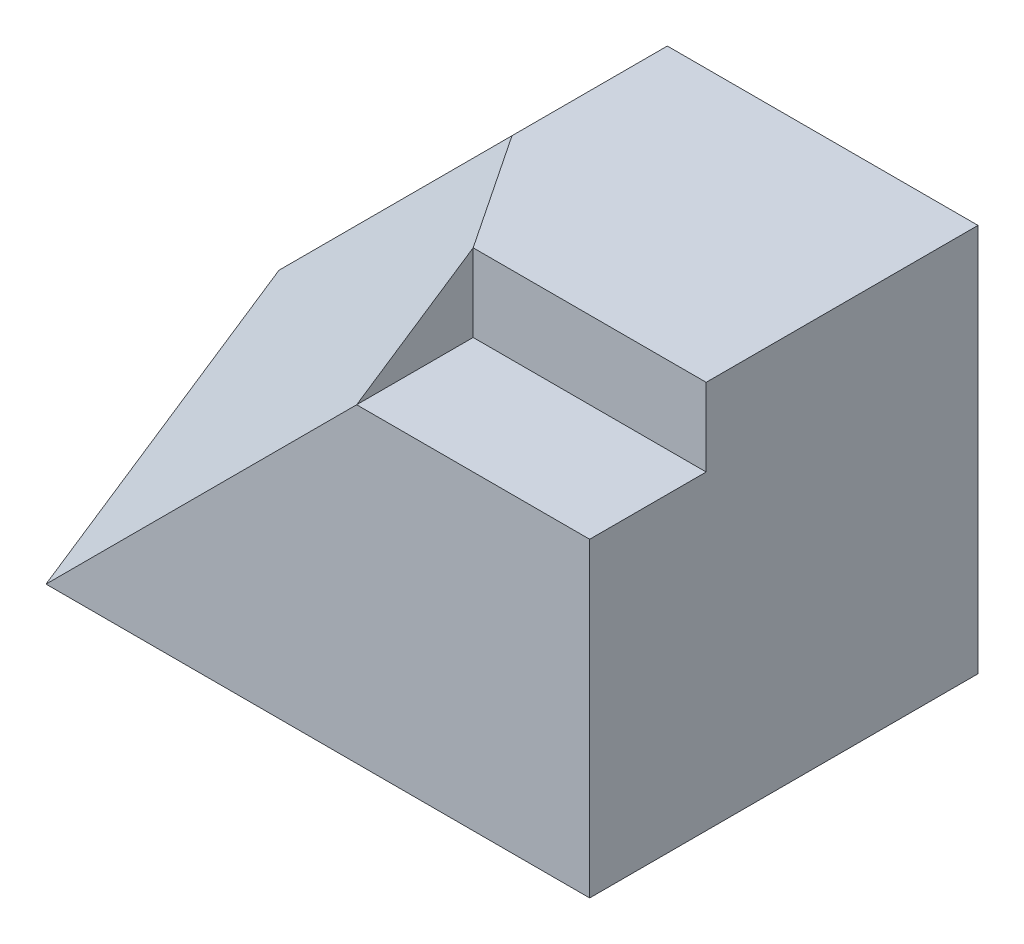
ISO-10303-21;
HEADER;
FILE_DESCRIPTION(('STEP AP214'),'2;1');
FILE_NAME('part.step','',(''),(''),'','','');
FILE_SCHEMA(('AUTOMOTIVE_DESIGN { 1 0 10303 214 1 1 1 1 }'));
ENDSEC;
DATA;
#1=APPLICATION_CONTEXT('core data for automotive mechanical design processes');
#2=APPLICATION_PROTOCOL_DEFINITION('international standard','automotive_design',2000,#1);
#3=PRODUCT_CONTEXT('',#1,'mechanical');
#4=PRODUCT('Part','Part','',(#3));
#5=PRODUCT_RELATED_PRODUCT_CATEGORY('part','',(#4));
#6=PRODUCT_DEFINITION_FORMATION('','',#4);
#7=PRODUCT_DEFINITION_CONTEXT('part definition',#1,'design');
#8=PRODUCT_DEFINITION('design','',#6,#7);
#9=PRODUCT_DEFINITION_SHAPE('','',#8);
#10=(LENGTH_UNIT() NAMED_UNIT(*) SI_UNIT(.MILLI.,.METRE.));
#11=(NAMED_UNIT(*) PLANE_ANGLE_UNIT() SI_UNIT($,.RADIAN.));
#12=(NAMED_UNIT(*) SI_UNIT($,.STERADIAN.) SOLID_ANGLE_UNIT());
#13=UNCERTAINTY_MEASURE_WITH_UNIT(LENGTH_MEASURE(1.E-05),#10,'distance_accuracy_value','');
#14=(GEOMETRIC_REPRESENTATION_CONTEXT(3) GLOBAL_UNCERTAINTY_ASSIGNED_CONTEXT((#13)) GLOBAL_UNIT_ASSIGNED_CONTEXT((#10,
#11,#12)) REPRESENTATION_CONTEXT('',''));
#15=CARTESIAN_POINT('',(0.,0.,0.));
#16=DIRECTION('',(0.,0.,1.));
#17=DIRECTION('',(1.,0.,0.));
#18=AXIS2_PLACEMENT_3D('',#15,#16,#17);
#19=CARTESIAN_POINT('',(40.,40.,35.));
#20=DIRECTION('',(0.,-1.,0.));
#21=DIRECTION('',(0.,0.,-1.));
#22=AXIS2_PLACEMENT_3D('',#19,#20,#21);
#23=PLANE('',#22);
#24=DIRECTION('',(1.,0.,0.));
#25=VECTOR('',#24,1.);
#26=CARTESIAN_POINT('',(40.,40.,35.));
#27=LINE('',#26,#25);
#28=CARTESIAN_POINT('',(40.,40.,35.));
#29=VERTEX_POINT('',#28);
#30=CARTESIAN_POINT('',(70.,40.,35.));
#31=VERTEX_POINT('',#30);
#32=EDGE_CURVE('E111',#29,#31,#27,.T.);
#33=ORIENTED_EDGE('',*,*,#32,.F.);
#34=DIRECTION('',(0.,0.,-1.));
#35=VECTOR('',#34,1.);
#36=CARTESIAN_POINT('',(40.,40.,50.));
#37=LINE('',#36,#35);
#38=CARTESIAN_POINT('',(40.,40.,50.));
#39=VERTEX_POINT('',#38);
#40=EDGE_CURVE('E97',#39,#29,#37,.T.);
#41=ORIENTED_EDGE('',*,*,#40,.F.);
#42=DIRECTION('',(1.,0.,0.));
#43=VECTOR('',#42,1.);
#44=CARTESIAN_POINT('',(40.,40.,50.));
#45=LINE('',#44,#43);
#46=CARTESIAN_POINT('',(70.,40.,50.));
#47=VERTEX_POINT('',#46);
#48=EDGE_CURVE('E104',#39,#47,#45,.T.);
#49=ORIENTED_EDGE('',*,*,#48,.T.);
#50=DIRECTION('',(0.,0.,1.));
#51=VECTOR('',#50,1.);
#52=CARTESIAN_POINT('',(70.,40.,35.));
#53=LINE('',#52,#51);
#54=EDGE_CURVE('E127',#31,#47,#53,.T.);
#55=ORIENTED_EDGE('',*,*,#54,.F.);
#56=EDGE_LOOP('',(#33,#41,#49,#55));
#57=FACE_BOUND('',#56,.T.);
#58=ADVANCED_FACE('F33',(#57),#23,.F.);
#59=CARTESIAN_POINT('',(0.,0.,35.));
#60=DIRECTION('',(0.,0.,-1.));
#61=DIRECTION('',(-1.,0.,0.));
#62=AXIS2_PLACEMENT_3D('',#59,#60,#61);
#63=PLANE('',#62);
#64=DIRECTION('',(-1.,0.,0.));
#65=VECTOR('',#64,1.);
#66=CARTESIAN_POINT('',(40.,50.,35.));
#67=LINE('',#66,#65);
#68=CARTESIAN_POINT('',(70.,50.,35.));
#69=VERTEX_POINT('',#68);
#70=CARTESIAN_POINT('',(40.,50.,35.));
#71=VERTEX_POINT('',#70);
#72=EDGE_CURVE('E167',#69,#71,#67,.T.);
#73=ORIENTED_EDGE('',*,*,#72,.T.);
#74=DIRECTION('',(0.,1.,0.));
#75=VECTOR('',#74,1.);
#76=CARTESIAN_POINT('',(40.,40.,35.));
#77=LINE('',#76,#75);
#78=EDGE_CURVE('E99',#29,#71,#77,.T.);
#79=ORIENTED_EDGE('',*,*,#78,.F.);
#80=ORIENTED_EDGE('',*,*,#32,.T.);
#81=DIRECTION('',(0.,1.,0.));
#82=VECTOR('',#81,1.);
#83=CARTESIAN_POINT('',(70.,40.,35.));
#84=LINE('',#83,#82);
#85=EDGE_CURVE('E168',#31,#69,#84,.T.);
#86=ORIENTED_EDGE('',*,*,#85,.T.);
#87=EDGE_LOOP('',(#73,#79,#80,#86));
#88=FACE_BOUND('',#87,.T.);
#89=ADVANCED_FACE('F176',(#88),#63,.F.);
#90=CARTESIAN_POINT('',(0.,0.,50.));
#91=DIRECTION('',(1.,0.,0.));
#92=DIRECTION('',(0.,0.,-1.));
#93=AXIS2_PLACEMENT_3D('',#90,#91,#92);
#94=PLANE('',#93);
#95=DIRECTION('',(0.,-1.,0.));
#96=VECTOR('',#95,1.);
#97=CARTESIAN_POINT('',(0.,0.,0.));
#98=LINE('',#97,#96);
#99=CARTESIAN_POINT('',(0.,20.,0.));
#100=VERTEX_POINT('',#99);
#101=CARTESIAN_POINT('',(0.,0.,0.));
#102=VERTEX_POINT('',#101);
#103=EDGE_CURVE('E135',#100,#102,#98,.T.);
#104=ORIENTED_EDGE('',*,*,#103,.T.);
#105=DIRECTION('',(0.,0.,-1.));
#106=VECTOR('',#105,1.);
#107=CARTESIAN_POINT('',(0.,0.,50.));
#108=LINE('',#107,#106);
#109=CARTESIAN_POINT('',(0.,0.,50.));
#110=VERTEX_POINT('',#109);
#111=EDGE_CURVE('E11',#110,#102,#108,.T.);
#112=ORIENTED_EDGE('',*,*,#111,.F.);
#113=DIRECTION('',(0.,-0.554700196225229,0.832050294337844));
#114=VECTOR('',#113,1.);
#115=CARTESIAN_POINT('',(0.,20.,20.));
#116=LINE('',#115,#114);
#117=CARTESIAN_POINT('',(0.,20.,20.));
#118=VERTEX_POINT('',#117);
#119=EDGE_CURVE('E123',#118,#110,#116,.T.);
#120=ORIENTED_EDGE('',*,*,#119,.F.);
#121=DIRECTION('',(0.,0.,1.));
#122=VECTOR('',#121,1.);
#123=CARTESIAN_POINT('',(0.,20.,0.));
#124=LINE('',#123,#122);
#125=EDGE_CURVE('E132',#100,#118,#124,.T.);
#126=ORIENTED_EDGE('',*,*,#125,.F.);
#127=EDGE_LOOP('',(#104,#112,#120,#126));
#128=FACE_BOUND('',#127,.T.);
#129=ADVANCED_FACE('F35',(#128),#94,.F.);
#130=CARTESIAN_POINT('',(0.,0.,50.));
#131=DIRECTION('',(0.,1.,0.));
#132=DIRECTION('',(0.,0.,1.));
#133=AXIS2_PLACEMENT_3D('',#130,#131,#132);
#134=PLANE('',#133);
#135=ORIENTED_EDGE('',*,*,#111,.T.);
#136=DIRECTION('',(1.,0.,0.));
#137=VECTOR('',#136,1.);
#138=CARTESIAN_POINT('',(0.,0.,0.));
#139=LINE('',#138,#137);
#140=CARTESIAN_POINT('',(70.,0.,0.));
#141=VERTEX_POINT('',#140);
#142=EDGE_CURVE('E143',#102,#141,#139,.T.);
#143=ORIENTED_EDGE('',*,*,#142,.T.);
#144=DIRECTION('',(0.,0.,-1.));
#145=VECTOR('',#144,1.);
#146=CARTESIAN_POINT('',(70.,0.,50.));
#147=LINE('',#146,#145);
#148=CARTESIAN_POINT('',(70.,0.,50.));
#149=VERTEX_POINT('',#148);
#150=EDGE_CURVE('E41',#149,#141,#147,.T.);
#151=ORIENTED_EDGE('',*,*,#150,.F.);
#152=DIRECTION('',(1.,0.,0.));
#153=VECTOR('',#152,1.);
#154=CARTESIAN_POINT('',(0.,0.,50.));
#155=LINE('',#154,#153);
#156=EDGE_CURVE('E137',#110,#149,#155,.T.);
#157=ORIENTED_EDGE('',*,*,#156,.F.);
#158=EDGE_LOOP('',(#135,#143,#151,#157));
#159=FACE_BOUND('',#158,.T.);
#160=ADVANCED_FACE('F183',(#159),#134,.F.);
#161=CARTESIAN_POINT('',(70.,0.,50.));
#162=DIRECTION('',(-1.,0.,0.));
#163=DIRECTION('',(0.,0.,1.));
#164=AXIS2_PLACEMENT_3D('',#161,#162,#163);
#165=PLANE('',#164);
#166=ORIENTED_EDGE('',*,*,#85,.F.);
#167=ORIENTED_EDGE('',*,*,#54,.T.);
#168=DIRECTION('',(0.,1.,0.));
#169=VECTOR('',#168,1.);
#170=CARTESIAN_POINT('',(70.,0.,50.));
#171=LINE('',#170,#169);
#172=EDGE_CURVE('E119',#149,#47,#171,.T.);
#173=ORIENTED_EDGE('',*,*,#172,.F.);
#174=ORIENTED_EDGE('',*,*,#150,.T.);
#175=DIRECTION('',(0.,1.,0.));
#176=VECTOR('',#175,1.);
#177=CARTESIAN_POINT('',(70.,0.,0.));
#178=LINE('',#177,#176);
#179=CARTESIAN_POINT('',(70.,50.,0.));
#180=VERTEX_POINT('',#179);
#181=EDGE_CURVE('E145',#141,#180,#178,.T.);
#182=ORIENTED_EDGE('',*,*,#181,.T.);
#183=DIRECTION('',(0.,0.,-1.));
#184=VECTOR('',#183,1.);
#185=CARTESIAN_POINT('',(70.,50.,50.));
#186=LINE('',#185,#184);
#187=EDGE_CURVE('E141',#69,#180,#186,.T.);
#188=ORIENTED_EDGE('',*,*,#187,.F.);
#189=EDGE_LOOP('',(#166,#167,#173,#174,#182,#188));
#190=FACE_BOUND('',#189,.T.);
#191=ADVANCED_FACE('F155',(#190),#165,.F.);
#192=CARTESIAN_POINT('',(0.,50.,50.));
#193=DIRECTION('',(0.,-1.,0.));
#194=DIRECTION('',(0.,0.,-1.));
#195=AXIS2_PLACEMENT_3D('',#192,#193,#194);
#196=PLANE('',#195);
#197=DIRECTION('',(0.,0.,1.));
#198=VECTOR('',#197,1.);
#199=CARTESIAN_POINT('',(30.,50.,0.));
#200=LINE('',#199,#198);
#201=CARTESIAN_POINT('',(30.,50.,0.));
#202=VERTEX_POINT('',#201);
#203=CARTESIAN_POINT('',(30.,50.,20.));
#204=VERTEX_POINT('',#203);
#205=EDGE_CURVE('E133',#202,#204,#200,.T.);
#206=ORIENTED_EDGE('',*,*,#205,.T.);
#207=DIRECTION('',(0.554700196225229,0.,0.832050294337844));
#208=VECTOR('',#207,1.);
#209=CARTESIAN_POINT('',(40.,50.,35.));
#210=LINE('',#209,#208);
#211=EDGE_CURVE('E105',#204,#71,#210,.T.);
#212=ORIENTED_EDGE('',*,*,#211,.T.);
#213=ORIENTED_EDGE('',*,*,#72,.F.);
#214=ORIENTED_EDGE('',*,*,#187,.T.);
#215=DIRECTION('',(-1.,0.,0.));
#216=VECTOR('',#215,1.);
#217=CARTESIAN_POINT('',(0.,50.,0.));
#218=LINE('',#217,#216);
#219=EDGE_CURVE('E139',#180,#202,#218,.T.);
#220=ORIENTED_EDGE('',*,*,#219,.T.);
#221=EDGE_LOOP('',(#206,#212,#213,#214,#220));
#222=FACE_BOUND('',#221,.T.);
#223=ADVANCED_FACE('F164',(#222),#196,.F.);
#224=CARTESIAN_POINT('',(0.,0.,50.));
#225=DIRECTION('',(0.,0.,-1.));
#226=DIRECTION('',(-1.,0.,0.));
#227=AXIS2_PLACEMENT_3D('',#224,#225,#226);
#228=PLANE('',#227);
#229=ORIENTED_EDGE('',*,*,#172,.T.);
#230=ORIENTED_EDGE('',*,*,#48,.F.);
#231=DIRECTION('',(0.707106781186547,0.707106781186548,0.));
#232=VECTOR('',#231,1.);
#233=CARTESIAN_POINT('',(0.,0.,50.));
#234=LINE('',#233,#232);
#235=EDGE_CURVE('E116',#110,#39,#234,.T.);
#236=ORIENTED_EDGE('',*,*,#235,.F.);
#237=ORIENTED_EDGE('',*,*,#156,.T.);
#238=EDGE_LOOP('',(#229,#230,#236,#237));
#239=FACE_BOUND('',#238,.T.);
#240=ADVANCED_FACE('F115',(#239),#228,.F.);
#241=CARTESIAN_POINT('',(0.,0.,0.));
#242=DIRECTION('',(0.,0.,-1.));
#243=DIRECTION('',(-1.,0.,0.));
#244=AXIS2_PLACEMENT_3D('',#241,#242,#243);
#245=PLANE('',#244);
#246=DIRECTION('',(0.707106781186547,0.707106781186547,0.));
#247=VECTOR('',#246,1.);
#248=CARTESIAN_POINT('',(0.,20.,0.));
#249=LINE('',#248,#247);
#250=EDGE_CURVE('E125',#100,#202,#249,.T.);
#251=ORIENTED_EDGE('',*,*,#250,.T.);
#252=ORIENTED_EDGE('',*,*,#219,.F.);
#253=ORIENTED_EDGE('',*,*,#181,.F.);
#254=ORIENTED_EDGE('',*,*,#142,.F.);
#255=ORIENTED_EDGE('',*,*,#103,.F.);
#256=EDGE_LOOP('',(#251,#252,#253,#254,#255));
#257=FACE_BOUND('',#256,.T.);
#258=ADVANCED_FACE('F161',(#257),#245,.T.);
#259=CARTESIAN_POINT('',(0.,20.,0.));
#260=DIRECTION('',(0.707106781186547,-0.707106781186547,0.));
#261=DIRECTION('',(0.707106781186548,0.707106781186548,0.));
#262=AXIS2_PLACEMENT_3D('',#259,#260,#261);
#263=PLANE('',#262);
#264=ORIENTED_EDGE('',*,*,#125,.T.);
#265=DIRECTION('',(-0.707106781186547,-0.707106781186547,0.));
#266=VECTOR('',#265,1.);
#267=CARTESIAN_POINT('',(30.,50.,20.));
#268=LINE('',#267,#266);
#269=EDGE_CURVE('E54',#204,#118,#268,.T.);
#270=ORIENTED_EDGE('',*,*,#269,.F.);
#271=ORIENTED_EDGE('',*,*,#205,.F.);
#272=ORIENTED_EDGE('',*,*,#250,.F.);
#273=EDGE_LOOP('',(#264,#270,#271,#272));
#274=FACE_BOUND('',#273,.T.);
#275=ADVANCED_FACE('F189',(#274),#263,.F.);
#276=CARTESIAN_POINT('',(-13.6363636363636,13.6363636363636,9.09090909090909));
#277=DIRECTION('',(0.639602149066831,-0.639602149066831,-0.426401432711221));
#278=DIRECTION('',(0.707106781186547,0.707106781186548,0.));
#279=AXIS2_PLACEMENT_3D('',#276,#277,#278);
#280=PLANE('',#279);
#281=ORIENTED_EDGE('',*,*,#269,.T.);
#282=ORIENTED_EDGE('',*,*,#119,.T.);
#283=ORIENTED_EDGE('',*,*,#235,.T.);
#284=DIRECTION('',(0.,-0.554700196225228,0.832050294337844));
#285=VECTOR('',#284,1.);
#286=CARTESIAN_POINT('',(40.,40.,50.));
#287=LINE('',#286,#285);
#288=EDGE_CURVE('E94',#71,#39,#287,.T.);
#289=ORIENTED_EDGE('',*,*,#288,.F.);
#290=ORIENTED_EDGE('',*,*,#211,.F.);
#291=EDGE_LOOP('',(#281,#282,#283,#289,#290));
#292=FACE_BOUND('',#291,.T.);
#293=ADVANCED_FACE('F122',(#292),#280,.F.);
#294=CARTESIAN_POINT('',(40.,0.,0.));
#295=DIRECTION('',(-1.,0.,0.));
#296=DIRECTION('',(0.,0.,1.));
#297=AXIS2_PLACEMENT_3D('',#294,#295,#296);
#298=PLANE('',#297);
#299=ORIENTED_EDGE('',*,*,#40,.T.);
#300=ORIENTED_EDGE('',*,*,#78,.T.);
#301=ORIENTED_EDGE('',*,*,#288,.T.);
#302=EDGE_LOOP('',(#299,#300,#301));
#303=FACE_BOUND('',#302,.T.);
#304=ADVANCED_FACE('F96',(#303),#298,.F.);
#305=CLOSED_SHELL('',(#58,#89,#129,#160,#191,#223,#240,#258,#275,#293,#304));
#306=MANIFOLD_SOLID_BREP('B2',#305);
#307=ADVANCED_BREP_SHAPE_REPRESENTATION('',(#18,#306),#14);
#308=SHAPE_DEFINITION_REPRESENTATION(#9,#307);
ENDSEC;
END-ISO-10303-21;
